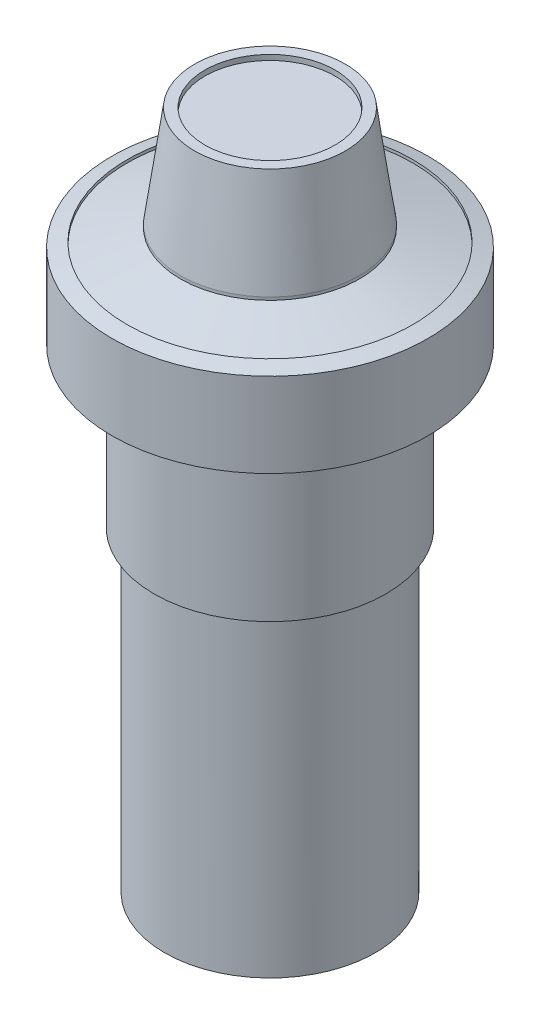
ISO-10303-21;
HEADER;
FILE_DESCRIPTION(('STEP AP214'),'2;1');
FILE_NAME('part.step','',(''),(''),'','','');
FILE_SCHEMA(('AUTOMOTIVE_DESIGN { 1 0 10303 214 1 1 1 1 }'));
ENDSEC;
DATA;
#1=APPLICATION_CONTEXT('core data for automotive mechanical design processes');
#2=APPLICATION_PROTOCOL_DEFINITION('international standard','automotive_design',2000,#1);
#3=PRODUCT_CONTEXT('',#1,'mechanical');
#4=PRODUCT('Part','Part','',(#3));
#5=PRODUCT_RELATED_PRODUCT_CATEGORY('part','',(#4));
#6=PRODUCT_DEFINITION_FORMATION('','',#4);
#7=PRODUCT_DEFINITION_CONTEXT('part definition',#1,'design');
#8=PRODUCT_DEFINITION('design','',#6,#7);
#9=PRODUCT_DEFINITION_SHAPE('','',#8);
#10=(LENGTH_UNIT() NAMED_UNIT(*) SI_UNIT(.MILLI.,.METRE.));
#11=(NAMED_UNIT(*) PLANE_ANGLE_UNIT() SI_UNIT($,.RADIAN.));
#12=(NAMED_UNIT(*) SI_UNIT($,.STERADIAN.) SOLID_ANGLE_UNIT());
#13=UNCERTAINTY_MEASURE_WITH_UNIT(LENGTH_MEASURE(1.E-05),#10,'distance_accuracy_value','');
#14=(GEOMETRIC_REPRESENTATION_CONTEXT(3) GLOBAL_UNCERTAINTY_ASSIGNED_CONTEXT((#13)) GLOBAL_UNIT_ASSIGNED_CONTEXT((#10,
#11,#12)) REPRESENTATION_CONTEXT('',''));
#15=CARTESIAN_POINT('',(0.,0.,0.));
#16=DIRECTION('',(0.,0.,1.));
#17=DIRECTION('',(1.,0.,0.));
#18=AXIS2_PLACEMENT_3D('',#15,#16,#17);
#19=CARTESIAN_POINT('',(0.,15.,0.));
#20=DIRECTION('',(0.,-1.,0.));
#21=DIRECTION('',(0.,0.,-1.));
#22=AXIS2_PLACEMENT_3D('',#19,#20,#21);
#23=CYLINDRICAL_SURFACE('',#22,11.);
#24=CARTESIAN_POINT('',(0.,15.,0.));
#25=DIRECTION('',(0.,1.,0.));
#26=DIRECTION('',(0.,0.,1.));
#27=AXIS2_PLACEMENT_3D('',#24,#25,#26);
#28=CIRCLE('',#27,11.);
#29=CARTESIAN_POINT('',(0.,15.,11.));
#30=VERTEX_POINT('',#29);
#31=EDGE_CURVE('E39',#30,#30,#28,.T.);
#32=ORIENTED_EDGE('',*,*,#31,.F.);
#33=EDGE_LOOP('',(#32));
#34=FACE_BOUND('',#33,.T.);
#35=CARTESIAN_POINT('',(0.,0.,0.));
#36=DIRECTION('',(0.,1.,0.));
#37=DIRECTION('',(0.,0.,1.));
#38=AXIS2_PLACEMENT_3D('',#35,#36,#37);
#39=CIRCLE('',#38,11.);
#40=CARTESIAN_POINT('',(0.,0.,11.));
#41=VERTEX_POINT('',#40);
#42=EDGE_CURVE('E43',#41,#41,#39,.T.);
#43=ORIENTED_EDGE('',*,*,#42,.T.);
#44=EDGE_LOOP('',(#43));
#45=FACE_BOUND('',#44,.T.);
#46=ADVANCED_FACE('F33',(#34,#45),#23,.T.);
#47=CARTESIAN_POINT('',(0.,0.,0.));
#48=DIRECTION('',(0.,1.,0.));
#49=DIRECTION('',(0.,0.,1.));
#50=AXIS2_PLACEMENT_3D('',#47,#48,#49);
#51=PLANE('',#50);
#52=CARTESIAN_POINT('',(0.,0.,0.));
#53=DIRECTION('',(0.,1.,0.));
#54=DIRECTION('',(0.,0.,1.));
#55=AXIS2_PLACEMENT_3D('',#52,#53,#54);
#56=CIRCLE('',#55,10.);
#57=CARTESIAN_POINT('',(0.,0.,10.));
#58=VERTEX_POINT('',#57);
#59=EDGE_CURVE('E10',#58,#58,#56,.F.);
#60=ORIENTED_EDGE('',*,*,#59,.F.);
#61=EDGE_LOOP('',(#60));
#62=FACE_BOUND('',#61,.T.);
#63=ORIENTED_EDGE('',*,*,#42,.F.);
#64=EDGE_LOOP('',(#63));
#65=FACE_BOUND('',#64,.T.);
#66=ADVANCED_FACE('F95',(#62,#65),#51,.F.);
#67=CARTESIAN_POINT('',(0.,23.,0.));
#68=DIRECTION('',(0.,-1.,0.));
#69=DIRECTION('',(0.,0.,-1.));
#70=AXIS2_PLACEMENT_3D('',#67,#68,#69);
#71=CYLINDRICAL_SURFACE('',#70,15.);
#72=CARTESIAN_POINT('',(0.,23.,0.));
#73=DIRECTION('',(0.,1.,0.));
#74=DIRECTION('',(0.,0.,1.));
#75=AXIS2_PLACEMENT_3D('',#72,#73,#74);
#76=CIRCLE('',#75,15.);
#77=CARTESIAN_POINT('',(0.,23.,15.));
#78=VERTEX_POINT('',#77);
#79=EDGE_CURVE('E48',#78,#78,#76,.T.);
#80=ORIENTED_EDGE('',*,*,#79,.F.);
#81=EDGE_LOOP('',(#80));
#82=FACE_BOUND('',#81,.T.);
#83=CARTESIAN_POINT('',(0.,15.,0.));
#84=DIRECTION('',(0.,1.,0.));
#85=DIRECTION('',(0.,0.,1.));
#86=AXIS2_PLACEMENT_3D('',#83,#84,#85);
#87=CIRCLE('',#86,15.);
#88=CARTESIAN_POINT('',(0.,15.,15.));
#89=VERTEX_POINT('',#88);
#90=EDGE_CURVE('E50',#89,#89,#87,.T.);
#91=ORIENTED_EDGE('',*,*,#90,.T.);
#92=EDGE_LOOP('',(#91));
#93=FACE_BOUND('',#92,.T.);
#94=ADVANCED_FACE('F100',(#82,#93),#71,.T.);
#95=CARTESIAN_POINT('',(0.,15.,0.));
#96=DIRECTION('',(0.,1.,0.));
#97=DIRECTION('',(0.,0.,1.));
#98=AXIS2_PLACEMENT_3D('',#95,#96,#97);
#99=PLANE('',#98);
#100=ORIENTED_EDGE('',*,*,#31,.T.);
#101=EDGE_LOOP('',(#100));
#102=FACE_BOUND('',#101,.T.);
#103=ORIENTED_EDGE('',*,*,#90,.F.);
#104=EDGE_LOOP('',(#103));
#105=FACE_BOUND('',#104,.T.);
#106=ADVANCED_FACE('F108',(#102,#105),#99,.F.);
#107=CARTESIAN_POINT('',(-7.1518256251263,34.488010937906,0.));
#108=DIRECTION('',(0.,1.,0.));
#109=DIRECTION('',(0.,0.,1.));
#110=AXIS2_PLACEMENT_3D('',#107,#108,#109);
#111=PLANE('',#110);
#112=CARTESIAN_POINT('',(0.,34.488010937906,0.));
#113=DIRECTION('',(0.,1.,0.));
#114=DIRECTION('',(0.,0.,1.));
#115=AXIS2_PLACEMENT_3D('',#112,#113,#114);
#116=CIRCLE('',#115,6.17706004232634);
#117=CARTESIAN_POINT('',(0.,34.488010937906,6.17706004232634));
#118=VERTEX_POINT('',#117);
#119=EDGE_CURVE('E71',#118,#118,#116,.T.);
#120=ORIENTED_EDGE('',*,*,#119,.F.);
#121=EDGE_LOOP('',(#120));
#122=FACE_BOUND('',#121,.T.);
#123=CARTESIAN_POINT('',(0.,34.488010937906,0.));
#124=DIRECTION('',(0.,1.,0.));
#125=DIRECTION('',(0.,0.,1.));
#126=AXIS2_PLACEMENT_3D('',#123,#124,#125);
#127=CIRCLE('',#126,7.1518256251263);
#128=CARTESIAN_POINT('',(0.,34.488010937906,7.1518256251263));
#129=VERTEX_POINT('',#128);
#130=EDGE_CURVE('E53',#129,#129,#127,.T.);
#131=ORIENTED_EDGE('',*,*,#130,.T.);
#132=EDGE_LOOP('',(#131));
#133=FACE_BOUND('',#132,.T.);
#134=ADVANCED_FACE('F114',(#122,#133),#111,.T.);
#135=CARTESIAN_POINT('',(0.,34.488010937906,0.));
#136=DIRECTION('',(0.,-1.,0.));
#137=DIRECTION('',(0.,0.,-1.));
#138=AXIS2_PLACEMENT_3D('',#135,#136,#137);
#139=CONICAL_SURFACE('',#138,7.1518256251263,0.13953671280339);
#140=CARTESIAN_POINT('',(0.,24.9163946877369,0.));
#141=DIRECTION('',(0.,1.,0.));
#142=DIRECTION('',(0.,0.,1.));
#143=AXIS2_PLACEMENT_3D('',#140,#141,#142);
#144=CIRCLE('',#143,8.49615375015004);
#145=CARTESIAN_POINT('',(0.,24.9163946877369,8.49615375015004));
#146=VERTEX_POINT('',#145);
#147=EDGE_CURVE('E58',#146,#146,#144,.T.);
#148=ORIENTED_EDGE('',*,*,#147,.T.);
#149=EDGE_LOOP('',(#148));
#150=FACE_BOUND('',#149,.T.);
#151=ORIENTED_EDGE('',*,*,#130,.F.);
#152=EDGE_LOOP('',(#151));
#153=FACE_BOUND('',#152,.T.);
#154=ADVANCED_FACE('F117',(#150,#153),#139,.T.);
#155=CARTESIAN_POINT('',(0.,31.3691696878509,0.));
#156=DIRECTION('',(0.,1.,0.));
#157=DIRECTION('',(0.,0.,1.));
#158=AXIS2_PLACEMENT_3D('',#155,#156,#157);
#159=CYLINDRICAL_SURFACE('',#158,8.49615375015004);
#160=CARTESIAN_POINT('',(0.,24.6389212629126,0.));
#161=DIRECTION('',(0.,1.,0.));
#162=DIRECTION('',(0.,0.,1.));
#163=AXIS2_PLACEMENT_3D('',#160,#161,#162);
#164=CIRCLE('',#163,8.49615375015004);
#165=CARTESIAN_POINT('',(0.,24.6389212629126,8.49615375015004));
#166=VERTEX_POINT('',#165);
#167=EDGE_CURVE('E61',#166,#166,#164,.T.);
#168=ORIENTED_EDGE('',*,*,#167,.T.);
#169=EDGE_LOOP('',(#168));
#170=FACE_BOUND('',#169,.T.);
#171=ORIENTED_EDGE('',*,*,#147,.F.);
#172=EDGE_LOOP('',(#171));
#173=FACE_BOUND('',#172,.T.);
#174=ADVANCED_FACE('F121',(#170,#173),#159,.T.);
#175=CARTESIAN_POINT('',(0.,24.6389212629126,0.));
#176=DIRECTION('',(0.,-1.,0.));
#177=DIRECTION('',(0.,0.,-1.));
#178=AXIS2_PLACEMENT_3D('',#175,#176,#177);
#179=CONICAL_SURFACE('',#178,8.49615375015004,1.28424983934728);
#180=CARTESIAN_POINT('',(0.,23.1451438249822,0.));
#181=DIRECTION('',(0.,1.,0.));
#182=DIRECTION('',(0.,0.,1.));
#183=AXIS2_PLACEMENT_3D('',#180,#181,#182);
#184=CIRCLE('',#183,13.5657246741158);
#185=CARTESIAN_POINT('',(0.,23.1451438249822,13.5657246741158));
#186=VERTEX_POINT('',#185);
#187=EDGE_CURVE('E64',#186,#186,#184,.T.);
#188=ORIENTED_EDGE('',*,*,#187,.T.);
#189=EDGE_LOOP('',(#188));
#190=FACE_BOUND('',#189,.T.);
#191=ORIENTED_EDGE('',*,*,#167,.F.);
#192=EDGE_LOOP('',(#191));
#193=FACE_BOUND('',#192,.T.);
#194=ADVANCED_FACE('F125',(#190,#193),#179,.T.);
#195=CARTESIAN_POINT('',(0.,31.3691696878509,0.));
#196=DIRECTION('',(0.,1.,0.));
#197=DIRECTION('',(0.,0.,1.));
#198=AXIS2_PLACEMENT_3D('',#195,#196,#197);
#199=CYLINDRICAL_SURFACE('',#198,13.5657246741158);
#200=CARTESIAN_POINT('',(0.,23.4226172498066,0.));
#201=DIRECTION('',(0.,1.,0.));
#202=DIRECTION('',(0.,0.,1.));
#203=AXIS2_PLACEMENT_3D('',#200,#201,#202);
#204=CIRCLE('',#203,13.5657246741158);
#205=CARTESIAN_POINT('',(0.,23.4226172498066,13.5657246741158));
#206=VERTEX_POINT('',#205);
#207=EDGE_CURVE('E67',#206,#206,#204,.T.);
#208=ORIENTED_EDGE('',*,*,#207,.T.);
#209=EDGE_LOOP('',(#208));
#210=FACE_BOUND('',#209,.T.);
#211=ORIENTED_EDGE('',*,*,#187,.F.);
#212=EDGE_LOOP('',(#211));
#213=FACE_BOUND('',#212,.T.);
#214=ADVANCED_FACE('F129',(#210,#213),#199,.F.);
#215=CARTESIAN_POINT('',(0.,23.4226172498066,0.));
#216=DIRECTION('',(0.,-1.,0.));
#217=DIRECTION('',(0.,0.,-1.));
#218=AXIS2_PLACEMENT_3D('',#215,#216,#217);
#219=CONICAL_SURFACE('',#218,13.5657246741158,1.28424983934728);
#220=ORIENTED_EDGE('',*,*,#79,.T.);
#221=EDGE_LOOP('',(#220));
#222=FACE_BOUND('',#221,.T.);
#223=ORIENTED_EDGE('',*,*,#207,.F.);
#224=EDGE_LOOP('',(#223));
#225=FACE_BOUND('',#224,.T.);
#226=ADVANCED_FACE('F133',(#222,#225),#219,.T.);
#227=CARTESIAN_POINT('',(0.,33.988010937906,0.));
#228=DIRECTION('',(0.,1.,0.));
#229=DIRECTION('',(0.,0.,1.));
#230=AXIS2_PLACEMENT_3D('',#227,#228,#229);
#231=CYLINDRICAL_SURFACE('',#230,6.17706004232634);
#232=CARTESIAN_POINT('',(0.,33.988010937906,0.));
#233=DIRECTION('',(0.,1.,0.));
#234=DIRECTION('',(0.,0.,1.));
#235=AXIS2_PLACEMENT_3D('',#232,#233,#234);
#236=CIRCLE('',#235,6.17706004232634);
#237=CARTESIAN_POINT('',(0.,33.988010937906,6.17706004232634));
#238=VERTEX_POINT('',#237);
#239=EDGE_CURVE('E70',#238,#238,#236,.T.);
#240=ORIENTED_EDGE('',*,*,#239,.F.);
#241=EDGE_LOOP('',(#240));
#242=FACE_BOUND('',#241,.T.);
#243=ORIENTED_EDGE('',*,*,#119,.T.);
#244=EDGE_LOOP('',(#243));
#245=FACE_BOUND('',#244,.T.);
#246=ADVANCED_FACE('F91',(#242,#245),#231,.F.);
#247=CARTESIAN_POINT('',(0.,33.988010937906,0.));
#248=DIRECTION('',(0.,1.,0.));
#249=DIRECTION('',(0.,0.,1.));
#250=AXIS2_PLACEMENT_3D('',#247,#248,#249);
#251=PLANE('',#250);
#252=ORIENTED_EDGE('',*,*,#239,.T.);
#253=EDGE_LOOP('',(#252));
#254=FACE_BOUND('',#253,.T.);
#255=ADVANCED_FACE('F84',(#254),#251,.T.);
#256=CARTESIAN_POINT('',(0.,-30.,0.));
#257=DIRECTION('',(0.,1.,0.));
#258=DIRECTION('',(0.,0.,1.));
#259=AXIS2_PLACEMENT_3D('',#256,#257,#258);
#260=CYLINDRICAL_SURFACE('',#259,10.);
#261=CARTESIAN_POINT('',(0.,-30.,0.));
#262=DIRECTION('',(0.,-1.,0.));
#263=DIRECTION('',(0.,0.,-1.));
#264=AXIS2_PLACEMENT_3D('',#261,#262,#263);
#265=CIRCLE('',#264,10.);
#266=CARTESIAN_POINT('',(0.,-30.,-10.));
#267=VERTEX_POINT('',#266);
#268=EDGE_CURVE('E74',#267,#267,#265,.T.);
#269=ORIENTED_EDGE('',*,*,#268,.F.);
#270=EDGE_LOOP('',(#269));
#271=FACE_BOUND('',#270,.T.);
#272=ORIENTED_EDGE('',*,*,#59,.T.);
#273=EDGE_LOOP('',(#272));
#274=FACE_BOUND('',#273,.T.);
#275=ADVANCED_FACE('F82',(#271,#274),#260,.T.);
#276=CARTESIAN_POINT('',(0.,-30.,0.));
#277=DIRECTION('',(0.,-1.,0.));
#278=DIRECTION('',(0.,0.,-1.));
#279=AXIS2_PLACEMENT_3D('',#276,#277,#278);
#280=PLANE('',#279);
#281=ORIENTED_EDGE('',*,*,#268,.T.);
#282=EDGE_LOOP('',(#281));
#283=FACE_BOUND('',#282,.T.);
#284=ADVANCED_FACE('F80',(#283),#280,.T.);
#285=CLOSED_SHELL('',(#46,#66,#94,#106,#134,#154,#174,#194,#214,#226,#246,#255,#275,#284));
#286=MANIFOLD_SOLID_BREP('B2',#285);
#287=ADVANCED_BREP_SHAPE_REPRESENTATION('',(#18,#286),#14);
#288=SHAPE_DEFINITION_REPRESENTATION(#9,#287);
ENDSEC;
END-ISO-10303-21;
